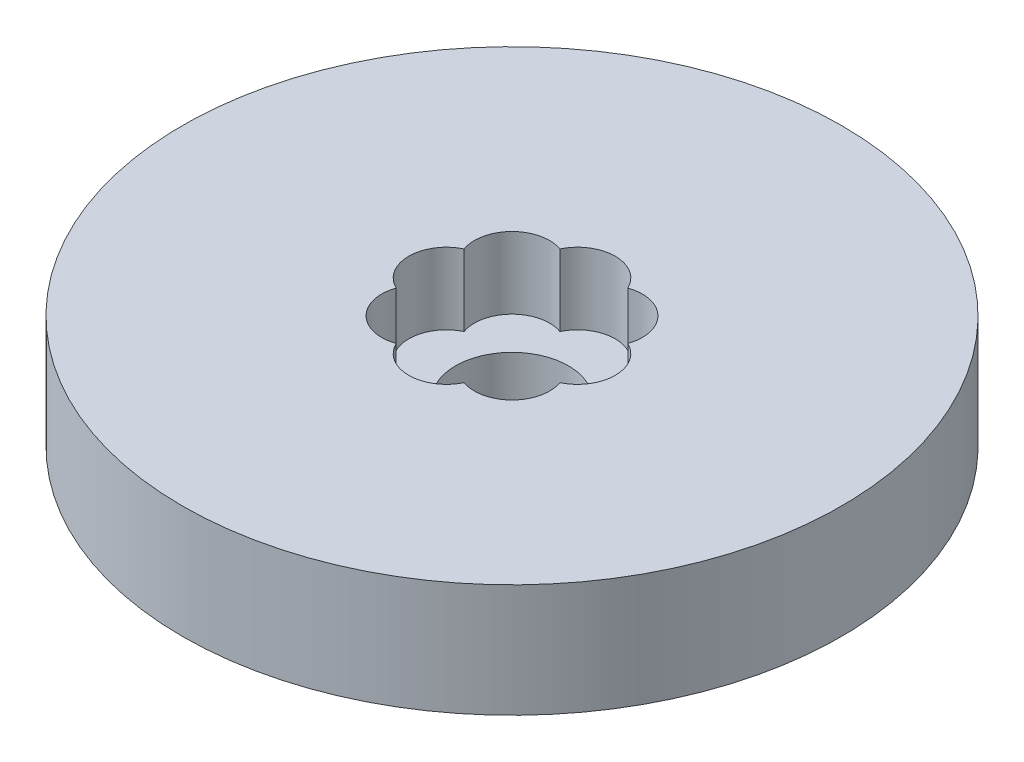
ISO-10303-21;
HEADER;
FILE_DESCRIPTION(('STEP AP214'),'2;1');
FILE_NAME('part.step','',(''),(''),'','','');
FILE_SCHEMA(('AUTOMOTIVE_DESIGN { 1 0 10303 214 1 1 1 1 }'));
ENDSEC;
DATA;
#1=APPLICATION_CONTEXT('core data for automotive mechanical design processes');
#2=APPLICATION_PROTOCOL_DEFINITION('international standard','automotive_design',2000,#1);
#3=PRODUCT_CONTEXT('',#1,'mechanical');
#4=PRODUCT('Part','Part','',(#3));
#5=PRODUCT_RELATED_PRODUCT_CATEGORY('part','',(#4));
#6=PRODUCT_DEFINITION_FORMATION('','',#4);
#7=PRODUCT_DEFINITION_CONTEXT('part definition',#1,'design');
#8=PRODUCT_DEFINITION('design','',#6,#7);
#9=PRODUCT_DEFINITION_SHAPE('','',#8);
#10=(LENGTH_UNIT() NAMED_UNIT(*) SI_UNIT(.MILLI.,.METRE.));
#11=(NAMED_UNIT(*) PLANE_ANGLE_UNIT() SI_UNIT($,.RADIAN.));
#12=(NAMED_UNIT(*) SI_UNIT($,.STERADIAN.) SOLID_ANGLE_UNIT());
#13=UNCERTAINTY_MEASURE_WITH_UNIT(LENGTH_MEASURE(1.E-05),#10,'distance_accuracy_value','');
#14=(GEOMETRIC_REPRESENTATION_CONTEXT(3) GLOBAL_UNCERTAINTY_ASSIGNED_CONTEXT((#13)) GLOBAL_UNIT_ASSIGNED_CONTEXT((#10,
#11,#12)) REPRESENTATION_CONTEXT('',''));
#15=CARTESIAN_POINT('',(0.,0.,0.));
#16=DIRECTION('',(0.,0.,1.));
#17=DIRECTION('',(1.,0.,0.));
#18=AXIS2_PLACEMENT_3D('',#15,#16,#17);
#19=CARTESIAN_POINT('',(0.,30.,0.));
#20=DIRECTION('',(0.,-1.,0.));
#21=DIRECTION('',(0.,0.,-1.));
#22=AXIS2_PLACEMENT_3D('',#19,#20,#21);
#23=CYLINDRICAL_SURFACE('',#22,15.);
#24=CARTESIAN_POINT('',(0.,0.,0.));
#25=DIRECTION('',(0.,1.,0.));
#26=DIRECTION('',(0.,0.,1.));
#27=AXIS2_PLACEMENT_3D('',#24,#25,#26);
#28=CIRCLE('',#27,15.);
#29=CARTESIAN_POINT('',(0.,0.,15.));
#30=VERTEX_POINT('',#29);
#31=EDGE_CURVE('E166',#30,#30,#28,.T.);
#32=ORIENTED_EDGE('',*,*,#31,.F.);
#33=EDGE_LOOP('',(#32));
#34=FACE_BOUND('',#33,.T.);
#35=CARTESIAN_POINT('',(0.,10.9953758746845,0.));
#36=DIRECTION('',(0.,1.,0.));
#37=DIRECTION('',(0.,0.,1.));
#38=AXIS2_PLACEMENT_3D('',#35,#36,#37);
#39=CIRCLE('',#38,15.);
#40=CARTESIAN_POINT('',(0.,10.9953758746845,15.));
#41=VERTEX_POINT('',#40);
#42=EDGE_CURVE('E11',#41,#41,#39,.T.);
#43=ORIENTED_EDGE('',*,*,#42,.T.);
#44=EDGE_LOOP('',(#43));
#45=FACE_BOUND('',#44,.T.);
#46=ADVANCED_FACE('F39',(#34,#45),#23,.F.);
#47=CARTESIAN_POINT('',(0.,30.,0.));
#48=DIRECTION('',(0.,-1.,0.));
#49=DIRECTION('',(0.,0.,-1.));
#50=AXIS2_PLACEMENT_3D('',#47,#48,#49);
#51=CYLINDRICAL_SURFACE('',#50,87.5);
#52=CARTESIAN_POINT('',(0.,30.,0.));
#53=DIRECTION('',(0.,1.,0.));
#54=DIRECTION('',(0.,0.,1.));
#55=AXIS2_PLACEMENT_3D('',#52,#53,#54);
#56=CIRCLE('',#55,87.5);
#57=CARTESIAN_POINT('',(0.,30.,87.5));
#58=VERTEX_POINT('',#57);
#59=EDGE_CURVE('E50',#58,#58,#56,.T.);
#60=ORIENTED_EDGE('',*,*,#59,.F.);
#61=EDGE_LOOP('',(#60));
#62=FACE_BOUND('',#61,.T.);
#63=CARTESIAN_POINT('',(0.,0.,0.));
#64=DIRECTION('',(0.,1.,0.));
#65=DIRECTION('',(0.,0.,1.));
#66=AXIS2_PLACEMENT_3D('',#63,#64,#65);
#67=CIRCLE('',#66,87.5);
#68=CARTESIAN_POINT('',(0.,0.,87.5));
#69=VERTEX_POINT('',#68);
#70=EDGE_CURVE('E173',#69,#69,#67,.T.);
#71=ORIENTED_EDGE('',*,*,#70,.T.);
#72=EDGE_LOOP('',(#71));
#73=FACE_BOUND('',#72,.T.);
#74=ADVANCED_FACE('F41',(#62,#73),#51,.T.);
#75=CARTESIAN_POINT('',(0.,30.,0.));
#76=DIRECTION('',(0.,1.,0.));
#77=DIRECTION('',(0.,0.,1.));
#78=AXIS2_PLACEMENT_3D('',#75,#76,#77);
#79=PLANE('',#78);
#80=CARTESIAN_POINT('',(-12.3095271740387,30.,12.3095271740387));
#81=DIRECTION('',(0.,1.,0.));
#82=DIRECTION('',(0.707106781186549,0.,0.707106781186546));
#83=AXIS2_PLACEMENT_3D('',#80,#81,#82);
#84=CIRCLE('',#83,10.);
#85=CARTESIAN_POINT('',(-21.7490678776284,30.,9.00875888388672));
#86=VERTEX_POINT('',#85);
#87=CARTESIAN_POINT('',(-9.00875888388665,30.,21.7490678776284));
#88=VERTEX_POINT('',#87);
#89=EDGE_CURVE('E159',#86,#88,#84,.T.);
#90=ORIENTED_EDGE('',*,*,#89,.F.);
#91=CARTESIAN_POINT('',(-17.4083002759257,30.,0.));
#92=DIRECTION('',(0.,1.,0.));
#93=DIRECTION('',(0.,0.,1.));
#94=AXIS2_PLACEMENT_3D('',#91,#92,#93);
#95=CIRCLE('',#94,10.);
#96=CARTESIAN_POINT('',(-21.7490678776286,30.,-9.00875888388663));
#97=VERTEX_POINT('',#96);
#98=EDGE_CURVE('E167',#97,#86,#95,.T.);
#99=ORIENTED_EDGE('',*,*,#98,.F.);
#100=CARTESIAN_POINT('',(-12.3095271740388,30.,-12.3095271740385));
#101=DIRECTION('',(0.,1.,0.));
#102=DIRECTION('',(-0.707106781186539,0.,0.707106781186556));
#103=AXIS2_PLACEMENT_3D('',#100,#101,#102);
#104=CIRCLE('',#103,10.);
#105=CARTESIAN_POINT('',(-9.00875888388695,30.,-21.7490678776283));
#106=VERTEX_POINT('',#105);
#107=EDGE_CURVE('E53',#106,#97,#104,.T.);
#108=ORIENTED_EDGE('',*,*,#107,.F.);
#109=CARTESIAN_POINT('',(-1.82342266663117E-13,30.,-17.4083002759257));
#110=DIRECTION('',(0.,1.,0.));
#111=DIRECTION('',(-1.,0.,0.));
#112=AXIS2_PLACEMENT_3D('',#109,#110,#111);
#113=CIRCLE('',#112,10.);
#114=CARTESIAN_POINT('',(9.0087588838865,30.,-21.7490678776285));
#115=VERTEX_POINT('',#114);
#116=EDGE_CURVE('E117',#115,#106,#113,.T.);
#117=ORIENTED_EDGE('',*,*,#116,.F.);
#118=CARTESIAN_POINT('',(12.3095271740386,30.,-12.3095271740388));
#119=DIRECTION('',(0.,1.,0.));
#120=DIRECTION('',(-0.707106781186554,0.,-0.707106781186541));
#121=AXIS2_PLACEMENT_3D('',#118,#119,#120);
#122=CIRCLE('',#121,10.);
#123=CARTESIAN_POINT('',(21.7490678776283,30.,-9.00875888388677));
#124=VERTEX_POINT('',#123);
#125=EDGE_CURVE('E120',#124,#115,#122,.T.);
#126=ORIENTED_EDGE('',*,*,#125,.F.);
#127=CARTESIAN_POINT('',(17.4083002759257,30.,0.));
#128=DIRECTION('',(0.,1.,0.));
#129=DIRECTION('',(0.,0.,-1.));
#130=AXIS2_PLACEMENT_3D('',#127,#128,#129);
#131=CIRCLE('',#130,10.);
#132=CARTESIAN_POINT('',(21.7490678776285,30.,9.00875888388668));
#133=VERTEX_POINT('',#132);
#134=EDGE_CURVE('E136',#133,#124,#131,.T.);
#135=ORIENTED_EDGE('',*,*,#134,.F.);
#136=CARTESIAN_POINT('',(12.3095271740387,30.,12.3095271740386));
#137=DIRECTION('',(0.,1.,0.));
#138=DIRECTION('',(0.707106781186544,0.,-0.707106781186551));
#139=AXIS2_PLACEMENT_3D('',#136,#137,#138);
#140=CIRCLE('',#139,10.);
#141=CARTESIAN_POINT('',(9.0087588838868,30.,21.7490678776283));
#142=VERTEX_POINT('',#141);
#143=EDGE_CURVE('E138',#142,#133,#140,.T.);
#144=ORIENTED_EDGE('',*,*,#143,.F.);
#145=CARTESIAN_POINT('',(0.,30.,17.4083002759257));
#146=DIRECTION('',(0.,1.,0.));
#147=DIRECTION('',(1.,0.,0.));
#148=AXIS2_PLACEMENT_3D('',#145,#146,#147);
#149=CIRCLE('',#148,10.);
#150=EDGE_CURVE('E146',#88,#142,#149,.T.);
#151=ORIENTED_EDGE('',*,*,#150,.F.);
#152=EDGE_LOOP('',(#90,#99,#108,#117,#126,#135,#144,#151));
#153=FACE_BOUND('',#152,.T.);
#154=ORIENTED_EDGE('',*,*,#59,.T.);
#155=EDGE_LOOP('',(#154));
#156=FACE_BOUND('',#155,.T.);
#157=ADVANCED_FACE('F181',(#153,#156),#79,.T.);
#158=CARTESIAN_POINT('',(0.,0.,0.));
#159=DIRECTION('',(0.,1.,0.));
#160=DIRECTION('',(0.,0.,1.));
#161=AXIS2_PLACEMENT_3D('',#158,#159,#160);
#162=PLANE('',#161);
#163=ORIENTED_EDGE('',*,*,#31,.T.);
#164=EDGE_LOOP('',(#163));
#165=FACE_BOUND('',#164,.T.);
#166=ORIENTED_EDGE('',*,*,#70,.F.);
#167=EDGE_LOOP('',(#166));
#168=FACE_BOUND('',#167,.T.);
#169=ADVANCED_FACE('F179',(#165,#168),#162,.F.);
#170=CARTESIAN_POINT('',(-17.4083002759257,10.9953758746845,0.));
#171=DIRECTION('',(0.,1.,0.));
#172=DIRECTION('',(0.,0.,1.));
#173=AXIS2_PLACEMENT_3D('',#170,#171,#172);
#174=CYLINDRICAL_SURFACE('',#173,10.);
#175=ORIENTED_EDGE('',*,*,#98,.T.);
#176=DIRECTION('',(0.,1.,0.));
#177=VECTOR('',#176,1.);
#178=CARTESIAN_POINT('',(-21.7490678776284,20.4976879373422,9.00875888388672));
#179=LINE('',#178,#177);
#180=CARTESIAN_POINT('',(-21.7490678776284,10.9953758746845,9.00875888388672));
#181=VERTEX_POINT('',#180);
#182=EDGE_CURVE('E65',#86,#181,#179,.F.);
#183=ORIENTED_EDGE('',*,*,#182,.T.);
#184=CARTESIAN_POINT('',(-17.4083002759257,10.9953758746845,0.));
#185=DIRECTION('',(0.,1.,0.));
#186=DIRECTION('',(0.,0.,1.));
#187=AXIS2_PLACEMENT_3D('',#184,#185,#186);
#188=CIRCLE('',#187,10.);
#189=CARTESIAN_POINT('',(-21.7490678776286,10.9953758746845,-9.00875888388663));
#190=VERTEX_POINT('',#189);
#191=EDGE_CURVE('E170',#190,#181,#188,.T.);
#192=ORIENTED_EDGE('',*,*,#191,.F.);
#193=DIRECTION('',(0.,1.,0.));
#194=VECTOR('',#193,1.);
#195=CARTESIAN_POINT('',(-21.7490678776286,20.4976879373422,-9.00875888388663));
#196=LINE('',#195,#194);
#197=EDGE_CURVE('E124',#190,#97,#196,.T.);
#198=ORIENTED_EDGE('',*,*,#197,.T.);
#199=EDGE_LOOP('',(#175,#183,#192,#198));
#200=FACE_BOUND('',#199,.T.);
#201=ADVANCED_FACE('F185',(#200),#174,.F.);
#202=CARTESIAN_POINT('',(-17.4083002759257,10.9953758746845,0.));
#203=DIRECTION('',(0.,1.,0.));
#204=DIRECTION('',(0.,0.,1.));
#205=AXIS2_PLACEMENT_3D('',#202,#203,#204);
#206=PLANE('',#205);
#207=ORIENTED_EDGE('',*,*,#191,.T.);
#208=CARTESIAN_POINT('',(-12.3095271740387,10.9953758746845,12.3095271740387));
#209=DIRECTION('',(0.,1.,0.));
#210=DIRECTION('',(0.707106781186549,0.,0.707106781186546));
#211=AXIS2_PLACEMENT_3D('',#208,#209,#210);
#212=CIRCLE('',#211,10.);
#213=CARTESIAN_POINT('',(-9.00875888388665,10.9953758746845,21.7490678776284));
#214=VERTEX_POINT('',#213);
#215=EDGE_CURVE('E161',#181,#214,#212,.T.);
#216=ORIENTED_EDGE('',*,*,#215,.T.);
#217=CARTESIAN_POINT('',(0.,10.9953758746845,17.4083002759257));
#218=DIRECTION('',(0.,1.,0.));
#219=DIRECTION('',(1.,0.,0.));
#220=AXIS2_PLACEMENT_3D('',#217,#218,#219);
#221=CIRCLE('',#220,10.);
#222=CARTESIAN_POINT('',(9.0087588838868,10.9953758746845,21.7490678776283));
#223=VERTEX_POINT('',#222);
#224=EDGE_CURVE('E149',#214,#223,#221,.T.);
#225=ORIENTED_EDGE('',*,*,#224,.T.);
#226=CARTESIAN_POINT('',(12.3095271740387,10.9953758746845,12.3095271740386));
#227=DIRECTION('',(0.,1.,0.));
#228=DIRECTION('',(0.707106781186544,0.,-0.707106781186551));
#229=AXIS2_PLACEMENT_3D('',#226,#227,#228);
#230=CIRCLE('',#229,10.);
#231=CARTESIAN_POINT('',(21.7490678776285,10.9953758746845,9.00875888388668));
#232=VERTEX_POINT('',#231);
#233=EDGE_CURVE('E143',#223,#232,#230,.T.);
#234=ORIENTED_EDGE('',*,*,#233,.T.);
#235=CARTESIAN_POINT('',(17.4083002759257,10.9953758746845,0.));
#236=DIRECTION('',(0.,1.,0.));
#237=DIRECTION('',(0.,0.,-1.));
#238=AXIS2_PLACEMENT_3D('',#235,#236,#237);
#239=CIRCLE('',#238,10.);
#240=CARTESIAN_POINT('',(21.7490678776283,10.9953758746845,-9.00875888388677));
#241=VERTEX_POINT('',#240);
#242=EDGE_CURVE('E140',#232,#241,#239,.T.);
#243=ORIENTED_EDGE('',*,*,#242,.T.);
#244=CARTESIAN_POINT('',(12.3095271740386,10.9953758746845,-12.3095271740388));
#245=DIRECTION('',(0.,1.,0.));
#246=DIRECTION('',(-0.707106781186554,0.,-0.707106781186541));
#247=AXIS2_PLACEMENT_3D('',#244,#245,#246);
#248=CIRCLE('',#247,10.);
#249=CARTESIAN_POINT('',(9.00875888388649,10.9953758746845,-21.7490678776285));
#250=VERTEX_POINT('',#249);
#251=EDGE_CURVE('E111',#241,#250,#248,.T.);
#252=ORIENTED_EDGE('',*,*,#251,.T.);
#253=CARTESIAN_POINT('',(-1.82342266663117E-13,10.9953758746845,-17.4083002759257));
#254=DIRECTION('',(0.,1.,0.));
#255=DIRECTION('',(-1.,0.,0.));
#256=AXIS2_PLACEMENT_3D('',#253,#254,#255);
#257=CIRCLE('',#256,10.);
#258=CARTESIAN_POINT('',(-9.00875888388695,10.9953758746845,-21.7490678776283));
#259=VERTEX_POINT('',#258);
#260=EDGE_CURVE('E104',#250,#259,#257,.T.);
#261=ORIENTED_EDGE('',*,*,#260,.T.);
#262=CARTESIAN_POINT('',(-12.3095271740388,10.9953758746845,-12.3095271740385));
#263=DIRECTION('',(0.,1.,0.));
#264=DIRECTION('',(-0.707106781186539,0.,0.707106781186556));
#265=AXIS2_PLACEMENT_3D('',#262,#263,#264);
#266=CIRCLE('',#265,10.);
#267=EDGE_CURVE('E112',#259,#190,#266,.T.);
#268=ORIENTED_EDGE('',*,*,#267,.T.);
#269=EDGE_LOOP('',(#207,#216,#225,#234,#243,#252,#261,#268));
#270=FACE_BOUND('',#269,.T.);
#271=ORIENTED_EDGE('',*,*,#42,.F.);
#272=EDGE_LOOP('',(#271));
#273=FACE_BOUND('',#272,.T.);
#274=ADVANCED_FACE('F107',(#270,#273),#206,.T.);
#275=CARTESIAN_POINT('',(-12.3095271740387,10.9953758746845,12.3095271740387));
#276=DIRECTION('',(0.,1.,0.));
#277=DIRECTION('',(0.,0.,1.));
#278=AXIS2_PLACEMENT_3D('',#275,#276,#277);
#279=CYLINDRICAL_SURFACE('',#278,10.);
#280=ORIENTED_EDGE('',*,*,#89,.T.);
#281=DIRECTION('',(0.,1.,0.));
#282=VECTOR('',#281,1.);
#283=CARTESIAN_POINT('',(-9.00875888388665,20.4976879373422,21.7490678776284));
#284=LINE('',#283,#282);
#285=EDGE_CURVE('E160',#88,#214,#284,.F.);
#286=ORIENTED_EDGE('',*,*,#285,.T.);
#287=ORIENTED_EDGE('',*,*,#215,.F.);
#288=ORIENTED_EDGE('',*,*,#182,.F.);
#289=EDGE_LOOP('',(#280,#286,#287,#288));
#290=FACE_BOUND('',#289,.T.);
#291=ADVANCED_FACE('F202',(#290),#279,.F.);
#292=CARTESIAN_POINT('',(-12.3095271740388,10.9953758746845,-12.3095271740385));
#293=DIRECTION('',(0.,1.,0.));
#294=DIRECTION('',(0.,0.,1.));
#295=AXIS2_PLACEMENT_3D('',#292,#293,#294);
#296=CYLINDRICAL_SURFACE('',#295,10.);
#297=ORIENTED_EDGE('',*,*,#267,.F.);
#298=DIRECTION('',(0.,1.,0.));
#299=VECTOR('',#298,1.);
#300=CARTESIAN_POINT('',(-9.00875888388695,20.4976879373422,-21.7490678776283));
#301=LINE('',#300,#299);
#302=EDGE_CURVE('E119',#106,#259,#301,.F.);
#303=ORIENTED_EDGE('',*,*,#302,.F.);
#304=ORIENTED_EDGE('',*,*,#107,.T.);
#305=ORIENTED_EDGE('',*,*,#197,.F.);
#306=EDGE_LOOP('',(#297,#303,#304,#305));
#307=FACE_BOUND('',#306,.T.);
#308=ADVANCED_FACE('F123',(#307),#296,.F.);
#309=CARTESIAN_POINT('',(0.,10.9953758746845,17.4083002759257));
#310=DIRECTION('',(0.,1.,0.));
#311=DIRECTION('',(0.,0.,1.));
#312=AXIS2_PLACEMENT_3D('',#309,#310,#311);
#313=CYLINDRICAL_SURFACE('',#312,10.);
#314=ORIENTED_EDGE('',*,*,#150,.T.);
#315=DIRECTION('',(0.,1.,0.));
#316=VECTOR('',#315,1.);
#317=CARTESIAN_POINT('',(9.0087588838868,20.4976879373422,21.7490678776283));
#318=LINE('',#317,#316);
#319=EDGE_CURVE('E141',#142,#223,#318,.F.);
#320=ORIENTED_EDGE('',*,*,#319,.T.);
#321=ORIENTED_EDGE('',*,*,#224,.F.);
#322=ORIENTED_EDGE('',*,*,#285,.F.);
#323=EDGE_LOOP('',(#314,#320,#321,#322));
#324=FACE_BOUND('',#323,.T.);
#325=ADVANCED_FACE('F208',(#324),#313,.F.);
#326=CARTESIAN_POINT('',(12.3095271740387,10.9953758746845,12.3095271740386));
#327=DIRECTION('',(0.,1.,0.));
#328=DIRECTION('',(0.,0.,1.));
#329=AXIS2_PLACEMENT_3D('',#326,#327,#328);
#330=CYLINDRICAL_SURFACE('',#329,10.);
#331=DIRECTION('',(0.,1.,0.));
#332=VECTOR('',#331,1.);
#333=CARTESIAN_POINT('',(21.7490678776285,20.4976879373422,9.00875888388668));
#334=LINE('',#333,#332);
#335=EDGE_CURVE('E151',#133,#232,#334,.F.);
#336=ORIENTED_EDGE('',*,*,#335,.T.);
#337=ORIENTED_EDGE('',*,*,#233,.F.);
#338=ORIENTED_EDGE('',*,*,#319,.F.);
#339=ORIENTED_EDGE('',*,*,#143,.T.);
#340=EDGE_LOOP('',(#336,#337,#338,#339));
#341=FACE_BOUND('',#340,.T.);
#342=ADVANCED_FACE('F211',(#341),#330,.F.);
#343=CARTESIAN_POINT('',(17.4083002759257,10.9953758746845,0.));
#344=DIRECTION('',(0.,1.,0.));
#345=DIRECTION('',(0.,0.,1.));
#346=AXIS2_PLACEMENT_3D('',#343,#344,#345);
#347=CYLINDRICAL_SURFACE('',#346,10.);
#348=ORIENTED_EDGE('',*,*,#134,.T.);
#349=DIRECTION('',(0.,1.,0.));
#350=VECTOR('',#349,1.);
#351=CARTESIAN_POINT('',(21.7490678776283,20.4976879373422,-9.00875888388677));
#352=LINE('',#351,#350);
#353=EDGE_CURVE('E131',#124,#241,#352,.F.);
#354=ORIENTED_EDGE('',*,*,#353,.T.);
#355=ORIENTED_EDGE('',*,*,#242,.F.);
#356=ORIENTED_EDGE('',*,*,#335,.F.);
#357=EDGE_LOOP('',(#348,#354,#355,#356));
#358=FACE_BOUND('',#357,.T.);
#359=ADVANCED_FACE('F214',(#358),#347,.F.);
#360=CARTESIAN_POINT('',(12.3095271740386,10.9953758746845,-12.3095271740388));
#361=DIRECTION('',(0.,1.,0.));
#362=DIRECTION('',(0.,0.,1.));
#363=AXIS2_PLACEMENT_3D('',#360,#361,#362);
#364=CYLINDRICAL_SURFACE('',#363,10.);
#365=DIRECTION('',(0.,1.,0.));
#366=VECTOR('',#365,1.);
#367=CARTESIAN_POINT('',(9.0087588838865,20.4976879373422,-21.7490678776285));
#368=LINE('',#367,#366);
#369=EDGE_CURVE('E154',#115,#250,#368,.F.);
#370=ORIENTED_EDGE('',*,*,#369,.T.);
#371=ORIENTED_EDGE('',*,*,#251,.F.);
#372=ORIENTED_EDGE('',*,*,#353,.F.);
#373=ORIENTED_EDGE('',*,*,#125,.T.);
#374=EDGE_LOOP('',(#370,#371,#372,#373));
#375=FACE_BOUND('',#374,.T.);
#376=ADVANCED_FACE('F218',(#375),#364,.F.);
#377=CARTESIAN_POINT('',(-1.82342266663117E-13,10.9953758746845,-17.4083002759257));
#378=DIRECTION('',(0.,1.,0.));
#379=DIRECTION('',(0.,0.,1.));
#380=AXIS2_PLACEMENT_3D('',#377,#378,#379);
#381=CYLINDRICAL_SURFACE('',#380,10.);
#382=ORIENTED_EDGE('',*,*,#116,.T.);
#383=ORIENTED_EDGE('',*,*,#302,.T.);
#384=ORIENTED_EDGE('',*,*,#260,.F.);
#385=ORIENTED_EDGE('',*,*,#369,.F.);
#386=EDGE_LOOP('',(#382,#383,#384,#385));
#387=FACE_BOUND('',#386,.T.);
#388=ADVANCED_FACE('F121',(#387),#381,.F.);
#389=CLOSED_SHELL('',(#46,#74,#157,#169,#201,#274,#291,#308,#325,#342,#359,#376,#388));
#390=MANIFOLD_SOLID_BREP('B2',#389);
#391=ADVANCED_BREP_SHAPE_REPRESENTATION('',(#18,#390),#14);
#392=SHAPE_DEFINITION_REPRESENTATION(#9,#391);
ENDSEC;
END-ISO-10303-21;
